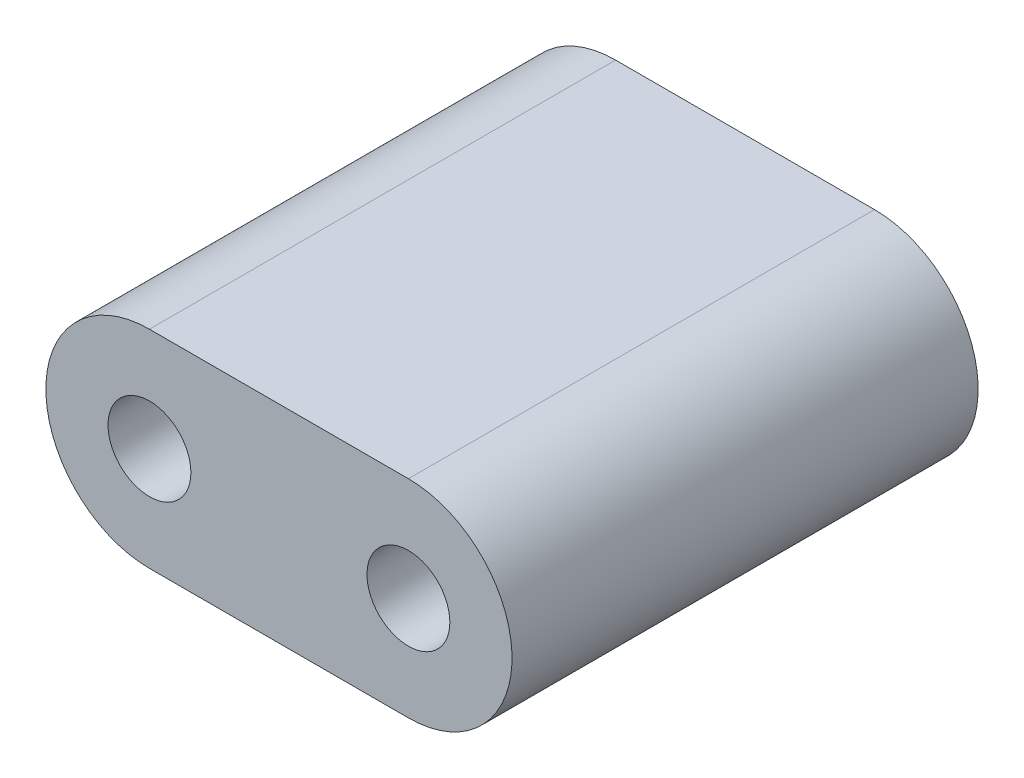
ISO-10303-21;
HEADER;
FILE_DESCRIPTION(('STEP AP214'),'2;1');
FILE_NAME('part.step','',(''),(''),'','','');
FILE_SCHEMA(('AUTOMOTIVE_DESIGN { 1 0 10303 214 1 1 1 1 }'));
ENDSEC;
DATA;
#1=APPLICATION_CONTEXT('core data for automotive mechanical design processes');
#2=APPLICATION_PROTOCOL_DEFINITION('international standard','automotive_design',2000,#1);
#3=PRODUCT_CONTEXT('',#1,'mechanical');
#4=PRODUCT('Part','Part','',(#3));
#5=PRODUCT_RELATED_PRODUCT_CATEGORY('part','',(#4));
#6=PRODUCT_DEFINITION_FORMATION('','',#4);
#7=PRODUCT_DEFINITION_CONTEXT('part definition',#1,'design');
#8=PRODUCT_DEFINITION('design','',#6,#7);
#9=PRODUCT_DEFINITION_SHAPE('','',#8);
#10=(LENGTH_UNIT() NAMED_UNIT(*) SI_UNIT(.MILLI.,.METRE.));
#11=(NAMED_UNIT(*) PLANE_ANGLE_UNIT() SI_UNIT($,.RADIAN.));
#12=(NAMED_UNIT(*) SI_UNIT($,.STERADIAN.) SOLID_ANGLE_UNIT());
#13=UNCERTAINTY_MEASURE_WITH_UNIT(LENGTH_MEASURE(1.E-05),#10,'distance_accuracy_value','');
#14=(GEOMETRIC_REPRESENTATION_CONTEXT(3) GLOBAL_UNCERTAINTY_ASSIGNED_CONTEXT((#13)) GLOBAL_UNIT_ASSIGNED_CONTEXT((#10,
#11,#12)) REPRESENTATION_CONTEXT('',''));
#15=CARTESIAN_POINT('',(0.,0.,0.));
#16=DIRECTION('',(0.,0.,1.));
#17=DIRECTION('',(1.,0.,0.));
#18=AXIS2_PLACEMENT_3D('',#15,#16,#17);
#19=CARTESIAN_POINT('',(-5.,0.,18.));
#20=DIRECTION('',(0.,0.,1.));
#21=DIRECTION('',(1.,0.,0.));
#22=AXIS2_PLACEMENT_3D('',#19,#20,#21);
#23=PLANE('',#22);
#24=CARTESIAN_POINT('',(-5.,0.,18.));
#25=DIRECTION('',(0.,0.,1.));
#26=DIRECTION('',(1.,0.,0.));
#27=AXIS2_PLACEMENT_3D('',#24,#25,#26);
#28=CIRCLE('',#27,1.6);
#29=CARTESIAN_POINT('',(-3.4,0.,18.));
#30=VERTEX_POINT('',#29);
#31=EDGE_CURVE('E101',#30,#30,#28,.T.);
#32=ORIENTED_EDGE('',*,*,#31,.F.);
#33=EDGE_LOOP('',(#32));
#34=FACE_BOUND('',#33,.T.);
#35=CARTESIAN_POINT('',(-5.,0.,18.));
#36=DIRECTION('',(0.,0.,1.));
#37=DIRECTION('',(1.,0.,0.));
#38=AXIS2_PLACEMENT_3D('',#35,#36,#37);
#39=CIRCLE('',#38,4.);
#40=CARTESIAN_POINT('',(-5.,4.,18.));
#41=VERTEX_POINT('',#40);
#42=CARTESIAN_POINT('',(-5.,-4.,18.));
#43=VERTEX_POINT('',#42);
#44=EDGE_CURVE('E86',#41,#43,#39,.T.);
#45=ORIENTED_EDGE('',*,*,#44,.T.);
#46=DIRECTION('',(1.,0.,0.));
#47=VECTOR('',#46,1.);
#48=CARTESIAN_POINT('',(-5.,-4.,18.));
#49=LINE('',#48,#47);
#50=CARTESIAN_POINT('',(5.,-4.,18.));
#51=VERTEX_POINT('',#50);
#52=EDGE_CURVE('E81',#43,#51,#49,.T.);
#53=ORIENTED_EDGE('',*,*,#52,.T.);
#54=CARTESIAN_POINT('',(5.,0.,18.));
#55=DIRECTION('',(0.,0.,1.));
#56=DIRECTION('',(1.,0.,0.));
#57=AXIS2_PLACEMENT_3D('',#54,#55,#56);
#58=CIRCLE('',#57,4.);
#59=CARTESIAN_POINT('',(5.,4.,18.));
#60=VERTEX_POINT('',#59);
#61=EDGE_CURVE('E84',#51,#60,#58,.T.);
#62=ORIENTED_EDGE('',*,*,#61,.T.);
#63=DIRECTION('',(-1.,0.,0.));
#64=VECTOR('',#63,1.);
#65=CARTESIAN_POINT('',(-5.,4.,18.));
#66=LINE('',#65,#64);
#67=EDGE_CURVE('E51',#60,#41,#66,.T.);
#68=ORIENTED_EDGE('',*,*,#67,.T.);
#69=EDGE_LOOP('',(#45,#53,#62,#68));
#70=FACE_BOUND('',#69,.T.);
#71=CARTESIAN_POINT('',(5.,0.,18.));
#72=DIRECTION('',(0.,0.,1.));
#73=DIRECTION('',(1.,0.,0.));
#74=AXIS2_PLACEMENT_3D('',#71,#72,#73);
#75=CIRCLE('',#74,1.6);
#76=CARTESIAN_POINT('',(6.6,0.,18.));
#77=VERTEX_POINT('',#76);
#78=EDGE_CURVE('E116',#77,#77,#75,.T.);
#79=ORIENTED_EDGE('',*,*,#78,.F.);
#80=EDGE_LOOP('',(#79));
#81=FACE_BOUND('',#80,.T.);
#82=ADVANCED_FACE('F34',(#34,#70,#81),#23,.T.);
#83=CARTESIAN_POINT('',(-5.,0.,0.));
#84=DIRECTION('',(0.,0.,1.));
#85=DIRECTION('',(1.,0.,0.));
#86=AXIS2_PLACEMENT_3D('',#83,#84,#85);
#87=PLANE('',#86);
#88=CARTESIAN_POINT('',(-5.,0.,0.));
#89=DIRECTION('',(0.,0.,1.));
#90=DIRECTION('',(1.,0.,0.));
#91=AXIS2_PLACEMENT_3D('',#88,#89,#90);
#92=CIRCLE('',#91,1.6);
#93=CARTESIAN_POINT('',(-3.4,0.,0.));
#94=VERTEX_POINT('',#93);
#95=EDGE_CURVE('E113',#94,#94,#92,.T.);
#96=ORIENTED_EDGE('',*,*,#95,.T.);
#97=EDGE_LOOP('',(#96));
#98=FACE_BOUND('',#97,.T.);
#99=CARTESIAN_POINT('',(-5.,0.,0.));
#100=DIRECTION('',(0.,0.,1.));
#101=DIRECTION('',(1.,0.,0.));
#102=AXIS2_PLACEMENT_3D('',#99,#100,#101);
#103=CIRCLE('',#102,4.);
#104=CARTESIAN_POINT('',(-5.,4.,0.));
#105=VERTEX_POINT('',#104);
#106=CARTESIAN_POINT('',(-5.,-4.,0.));
#107=VERTEX_POINT('',#106);
#108=EDGE_CURVE('E98',#105,#107,#103,.T.);
#109=ORIENTED_EDGE('',*,*,#108,.F.);
#110=DIRECTION('',(-1.,0.,0.));
#111=VECTOR('',#110,1.);
#112=CARTESIAN_POINT('',(-5.,4.,0.));
#113=LINE('',#112,#111);
#114=CARTESIAN_POINT('',(5.,4.,0.));
#115=VERTEX_POINT('',#114);
#116=EDGE_CURVE('E74',#115,#105,#113,.T.);
#117=ORIENTED_EDGE('',*,*,#116,.F.);
#118=CARTESIAN_POINT('',(5.,0.,0.));
#119=DIRECTION('',(0.,0.,1.));
#120=DIRECTION('',(1.,0.,0.));
#121=AXIS2_PLACEMENT_3D('',#118,#119,#120);
#122=CIRCLE('',#121,4.);
#123=CARTESIAN_POINT('',(5.,-4.,0.));
#124=VERTEX_POINT('',#123);
#125=EDGE_CURVE('E68',#124,#115,#122,.T.);
#126=ORIENTED_EDGE('',*,*,#125,.F.);
#127=DIRECTION('',(1.,0.,0.));
#128=VECTOR('',#127,1.);
#129=CARTESIAN_POINT('',(-5.,-4.,0.));
#130=LINE('',#129,#128);
#131=EDGE_CURVE('E90',#107,#124,#130,.T.);
#132=ORIENTED_EDGE('',*,*,#131,.F.);
#133=EDGE_LOOP('',(#109,#117,#126,#132));
#134=FACE_BOUND('',#133,.T.);
#135=CARTESIAN_POINT('',(5.,0.,0.));
#136=DIRECTION('',(0.,0.,1.));
#137=DIRECTION('',(1.,0.,0.));
#138=AXIS2_PLACEMENT_3D('',#135,#136,#137);
#139=CIRCLE('',#138,1.6);
#140=CARTESIAN_POINT('',(6.6,0.,0.));
#141=VERTEX_POINT('',#140);
#142=EDGE_CURVE('E119',#141,#141,#139,.T.);
#143=ORIENTED_EDGE('',*,*,#142,.T.);
#144=EDGE_LOOP('',(#143));
#145=FACE_BOUND('',#144,.T.);
#146=ADVANCED_FACE('F109',(#98,#134,#145),#87,.F.);
#147=CARTESIAN_POINT('',(-5.,0.,18.));
#148=DIRECTION('',(0.,0.,-1.));
#149=DIRECTION('',(-1.,0.,0.));
#150=AXIS2_PLACEMENT_3D('',#147,#148,#149);
#151=CYLINDRICAL_SURFACE('',#150,4.);
#152=ORIENTED_EDGE('',*,*,#108,.T.);
#153=DIRECTION('',(0.,0.,-1.));
#154=VECTOR('',#153,1.);
#155=CARTESIAN_POINT('',(-5.,-4.,18.));
#156=LINE('',#155,#154);
#157=EDGE_CURVE('E11',#43,#107,#156,.T.);
#158=ORIENTED_EDGE('',*,*,#157,.F.);
#159=ORIENTED_EDGE('',*,*,#44,.F.);
#160=DIRECTION('',(0.,0.,-1.));
#161=VECTOR('',#160,1.);
#162=CARTESIAN_POINT('',(-5.,4.,18.));
#163=LINE('',#162,#161);
#164=EDGE_CURVE('E94',#41,#105,#163,.T.);
#165=ORIENTED_EDGE('',*,*,#164,.T.);
#166=EDGE_LOOP('',(#152,#158,#159,#165));
#167=FACE_BOUND('',#166,.T.);
#168=ADVANCED_FACE('F36',(#167),#151,.T.);
#169=CARTESIAN_POINT('',(-5.,-4.,18.));
#170=DIRECTION('',(0.,1.,0.));
#171=DIRECTION('',(-1.,0.,0.));
#172=AXIS2_PLACEMENT_3D('',#169,#170,#171);
#173=PLANE('',#172);
#174=ORIENTED_EDGE('',*,*,#131,.T.);
#175=DIRECTION('',(0.,0.,-1.));
#176=VECTOR('',#175,1.);
#177=CARTESIAN_POINT('',(5.,-4.,18.));
#178=LINE('',#177,#176);
#179=EDGE_CURVE('E43',#51,#124,#178,.T.);
#180=ORIENTED_EDGE('',*,*,#179,.F.);
#181=ORIENTED_EDGE('',*,*,#52,.F.);
#182=ORIENTED_EDGE('',*,*,#157,.T.);
#183=EDGE_LOOP('',(#174,#180,#181,#182));
#184=FACE_BOUND('',#183,.T.);
#185=ADVANCED_FACE('F89',(#184),#173,.F.);
#186=CARTESIAN_POINT('',(5.,0.,18.));
#187=DIRECTION('',(0.,0.,-1.));
#188=DIRECTION('',(-1.,0.,0.));
#189=AXIS2_PLACEMENT_3D('',#186,#187,#188);
#190=CYLINDRICAL_SURFACE('',#189,4.);
#191=ORIENTED_EDGE('',*,*,#125,.T.);
#192=DIRECTION('',(0.,0.,-1.));
#193=VECTOR('',#192,1.);
#194=CARTESIAN_POINT('',(5.,4.,18.));
#195=LINE('',#194,#193);
#196=EDGE_CURVE('E91',#60,#115,#195,.T.);
#197=ORIENTED_EDGE('',*,*,#196,.F.);
#198=ORIENTED_EDGE('',*,*,#61,.F.);
#199=ORIENTED_EDGE('',*,*,#179,.T.);
#200=EDGE_LOOP('',(#191,#197,#198,#199));
#201=FACE_BOUND('',#200,.T.);
#202=ADVANCED_FACE('F92',(#201),#190,.T.);
#203=CARTESIAN_POINT('',(-5.,4.,18.));
#204=DIRECTION('',(0.,-1.,0.));
#205=DIRECTION('',(1.,0.,0.));
#206=AXIS2_PLACEMENT_3D('',#203,#204,#205);
#207=PLANE('',#206);
#208=ORIENTED_EDGE('',*,*,#116,.T.);
#209=ORIENTED_EDGE('',*,*,#164,.F.);
#210=ORIENTED_EDGE('',*,*,#67,.F.);
#211=ORIENTED_EDGE('',*,*,#196,.T.);
#212=EDGE_LOOP('',(#208,#209,#210,#211));
#213=FACE_BOUND('',#212,.T.);
#214=ADVANCED_FACE('F106',(#213),#207,.F.);
#215=CARTESIAN_POINT('',(-5.,0.,18.));
#216=DIRECTION('',(0.,0.,-1.));
#217=DIRECTION('',(-1.,0.,0.));
#218=AXIS2_PLACEMENT_3D('',#215,#216,#217);
#219=CYLINDRICAL_SURFACE('',#218,1.6);
#220=ORIENTED_EDGE('',*,*,#31,.T.);
#221=EDGE_LOOP('',(#220));
#222=FACE_BOUND('',#221,.T.);
#223=ORIENTED_EDGE('',*,*,#95,.F.);
#224=EDGE_LOOP('',(#223));
#225=FACE_BOUND('',#224,.T.);
#226=ADVANCED_FACE('F137',(#222,#225),#219,.F.);
#227=CARTESIAN_POINT('',(5.,0.,18.));
#228=DIRECTION('',(0.,0.,-1.));
#229=DIRECTION('',(-1.,0.,0.));
#230=AXIS2_PLACEMENT_3D('',#227,#228,#229);
#231=CYLINDRICAL_SURFACE('',#230,1.6);
#232=ORIENTED_EDGE('',*,*,#78,.T.);
#233=EDGE_LOOP('',(#232));
#234=FACE_BOUND('',#233,.T.);
#235=ORIENTED_EDGE('',*,*,#142,.F.);
#236=EDGE_LOOP('',(#235));
#237=FACE_BOUND('',#236,.T.);
#238=ADVANCED_FACE('F125',(#234,#237),#231,.F.);
#239=CLOSED_SHELL('',(#82,#146,#168,#185,#202,#214,#226,#238));
#240=MANIFOLD_SOLID_BREP('B2',#239);
#241=ADVANCED_BREP_SHAPE_REPRESENTATION('',(#18,#240),#14);
#242=SHAPE_DEFINITION_REPRESENTATION(#9,#241);
ENDSEC;
END-ISO-10303-21;
